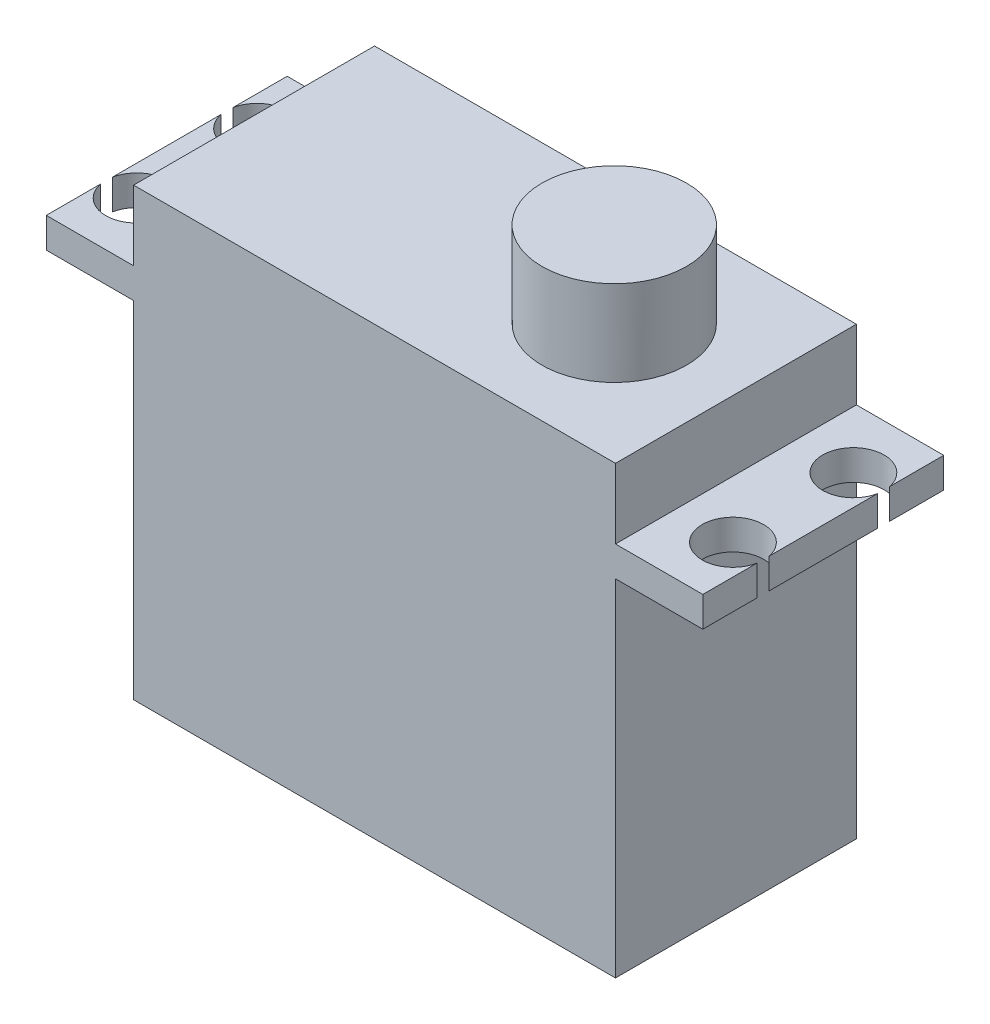
ISO-10303-21;
HEADER;
FILE_DESCRIPTION(('STEP AP214'),'2;1');
FILE_NAME('part.step','',(''),(''),'','','');
FILE_SCHEMA(('AUTOMOTIVE_DESIGN { 1 0 10303 214 1 1 1 1 }'));
ENDSEC;
DATA;
#1=APPLICATION_CONTEXT('core data for automotive mechanical design processes');
#2=APPLICATION_PROTOCOL_DEFINITION('international standard','automotive_design',2000,#1);
#3=PRODUCT_CONTEXT('',#1,'mechanical');
#4=PRODUCT('Part','Part','',(#3));
#5=PRODUCT_RELATED_PRODUCT_CATEGORY('part','',(#4));
#6=PRODUCT_DEFINITION_FORMATION('','',#4);
#7=PRODUCT_DEFINITION_CONTEXT('part definition',#1,'design');
#8=PRODUCT_DEFINITION('design','',#6,#7);
#9=PRODUCT_DEFINITION_SHAPE('','',#8);
#10=(LENGTH_UNIT() NAMED_UNIT(*) SI_UNIT(.MILLI.,.METRE.));
#11=(NAMED_UNIT(*) PLANE_ANGLE_UNIT() SI_UNIT($,.RADIAN.));
#12=(NAMED_UNIT(*) SI_UNIT($,.STERADIAN.) SOLID_ANGLE_UNIT());
#13=UNCERTAINTY_MEASURE_WITH_UNIT(LENGTH_MEASURE(1.E-05),#10,'distance_accuracy_value','');
#14=(GEOMETRIC_REPRESENTATION_CONTEXT(3) GLOBAL_UNCERTAINTY_ASSIGNED_CONTEXT((#13)) GLOBAL_UNIT_ASSIGNED_CONTEXT((#10,
#11,#12)) REPRESENTATION_CONTEXT('',''));
#15=CARTESIAN_POINT('',(0.,0.,0.));
#16=DIRECTION('',(0.,0.,1.));
#17=DIRECTION('',(1.,0.,0.));
#18=AXIS2_PLACEMENT_3D('',#15,#16,#17);
#19=CARTESIAN_POINT('',(27.25,31.2,10.));
#20=DIRECTION('',(-1.,0.,0.));
#21=DIRECTION('',(0.,0.,1.));
#22=AXIS2_PLACEMENT_3D('',#19,#20,#21);
#23=PLANE('',#22);
#24=DIRECTION('',(0.,0.,-1.));
#25=VECTOR('',#24,1.);
#26=CARTESIAN_POINT('',(27.25,28.7,10.));
#27=LINE('',#26,#25);
#28=CARTESIAN_POINT('',(27.25,28.7,4.497506218944));
#29=VERTEX_POINT('',#28);
#30=CARTESIAN_POINT('',(27.25,28.7,-4.49750621894393));
#31=VERTEX_POINT('',#30);
#32=EDGE_CURVE('E402',#29,#31,#27,.T.);
#33=ORIENTED_EDGE('',*,*,#32,.T.);
#34=DIRECTION('',(0.,1.,0.));
#35=VECTOR('',#34,1.);
#36=CARTESIAN_POINT('',(27.25,24.1,-4.49750621894393));
#37=LINE('',#36,#35);
#38=CARTESIAN_POINT('',(27.25,31.2,-4.49750621894393));
#39=VERTEX_POINT('',#38);
#40=EDGE_CURVE('E11',#31,#39,#37,.T.);
#41=ORIENTED_EDGE('',*,*,#40,.T.);
#42=DIRECTION('',(0.,0.,-1.));
#43=VECTOR('',#42,1.);
#44=CARTESIAN_POINT('',(27.25,31.2,10.));
#45=LINE('',#44,#43);
#46=CARTESIAN_POINT('',(27.25,31.2,4.497506218944));
#47=VERTEX_POINT('',#46);
#48=EDGE_CURVE('E234',#47,#39,#45,.T.);
#49=ORIENTED_EDGE('',*,*,#48,.F.);
#50=DIRECTION('',(0.,1.,0.));
#51=VECTOR('',#50,1.);
#52=CARTESIAN_POINT('',(27.25,24.1,4.497506218944));
#53=LINE('',#52,#51);
#54=EDGE_CURVE('E382',#47,#29,#53,.F.);
#55=ORIENTED_EDGE('',*,*,#54,.T.);
#56=EDGE_LOOP('',(#33,#41,#49,#55));
#57=FACE_BOUND('',#56,.T.);
#58=ADVANCED_FACE('F43',(#57),#23,.F.);
#59=CARTESIAN_POINT('',(27.25,28.7,10.));
#60=VERTEX_POINT('',#59);
#61=CARTESIAN_POINT('',(27.25,28.7,5.50249378105603));
#62=VERTEX_POINT('',#61);
#63=EDGE_CURVE('E403',#60,#62,#27,.T.);
#64=ORIENTED_EDGE('',*,*,#63,.T.);
#65=DIRECTION('',(0.,1.,0.));
#66=VECTOR('',#65,1.);
#67=CARTESIAN_POINT('',(27.25,24.1,5.50249378105603));
#68=LINE('',#67,#66);
#69=CARTESIAN_POINT('',(27.25,31.2,5.50249378105603));
#70=VERTEX_POINT('',#69);
#71=EDGE_CURVE('E385',#62,#70,#68,.T.);
#72=ORIENTED_EDGE('',*,*,#71,.T.);
#73=CARTESIAN_POINT('',(27.25,31.2,10.));
#74=VERTEX_POINT('',#73);
#75=EDGE_CURVE('E229',#74,#70,#45,.T.);
#76=ORIENTED_EDGE('',*,*,#75,.F.);
#77=DIRECTION('',(0.,-1.,0.));
#78=VECTOR('',#77,1.);
#79=CARTESIAN_POINT('',(27.25,31.2,10.));
#80=LINE('',#79,#78);
#81=EDGE_CURVE('E320',#74,#60,#80,.T.);
#82=ORIENTED_EDGE('',*,*,#81,.T.);
#83=EDGE_LOOP('',(#64,#72,#76,#82));
#84=FACE_BOUND('',#83,.T.);
#85=ADVANCED_FACE('F430',(#84),#23,.F.);
#86=CARTESIAN_POINT('',(-27.25,31.2,10.));
#87=DIRECTION('',(1.,0.,0.));
#88=DIRECTION('',(0.,0.,-1.));
#89=AXIS2_PLACEMENT_3D('',#86,#87,#88);
#90=PLANE('',#89);
#91=DIRECTION('',(0.,0.,1.));
#92=VECTOR('',#91,1.);
#93=CARTESIAN_POINT('',(-27.25,28.7,10.));
#94=LINE('',#93,#92);
#95=CARTESIAN_POINT('',(-27.25,28.7,-4.49750621894395));
#96=VERTEX_POINT('',#95);
#97=CARTESIAN_POINT('',(-27.25,28.7,4.49750621894395));
#98=VERTEX_POINT('',#97);
#99=EDGE_CURVE('E304',#96,#98,#94,.T.);
#100=ORIENTED_EDGE('',*,*,#99,.T.);
#101=DIRECTION('',(0.,1.,0.));
#102=VECTOR('',#101,1.);
#103=CARTESIAN_POINT('',(-27.25,24.1,4.49750621894395));
#104=LINE('',#103,#102);
#105=CARTESIAN_POINT('',(-27.25,31.2,4.49750621894395));
#106=VERTEX_POINT('',#105);
#107=EDGE_CURVE('E281',#98,#106,#104,.T.);
#108=ORIENTED_EDGE('',*,*,#107,.T.);
#109=DIRECTION('',(0.,0.,1.));
#110=VECTOR('',#109,1.);
#111=CARTESIAN_POINT('',(-27.25,31.2,10.));
#112=LINE('',#111,#110);
#113=CARTESIAN_POINT('',(-27.25,31.2,-4.49750621894395));
#114=VERTEX_POINT('',#113);
#115=EDGE_CURVE('E211',#114,#106,#112,.T.);
#116=ORIENTED_EDGE('',*,*,#115,.F.);
#117=DIRECTION('',(0.,1.,0.));
#118=VECTOR('',#117,1.);
#119=CARTESIAN_POINT('',(-27.25,24.1,-4.49750621894395));
#120=LINE('',#119,#118);
#121=EDGE_CURVE('E186',#114,#96,#120,.F.);
#122=ORIENTED_EDGE('',*,*,#121,.T.);
#123=EDGE_LOOP('',(#100,#108,#116,#122));
#124=FACE_BOUND('',#123,.T.);
#125=ADVANCED_FACE('F302',(#124),#90,.F.);
#126=CARTESIAN_POINT('',(-27.25,28.7,-10.));
#127=VERTEX_POINT('',#126);
#128=CARTESIAN_POINT('',(-27.25,28.7,-5.50249378105605));
#129=VERTEX_POINT('',#128);
#130=EDGE_CURVE('E201',#127,#129,#94,.T.);
#131=ORIENTED_EDGE('',*,*,#130,.T.);
#132=DIRECTION('',(0.,1.,0.));
#133=VECTOR('',#132,1.);
#134=CARTESIAN_POINT('',(-27.25,24.1,-5.50249378105605));
#135=LINE('',#134,#133);
#136=CARTESIAN_POINT('',(-27.25,31.2,-5.50249378105605));
#137=VERTEX_POINT('',#136);
#138=EDGE_CURVE('E183',#129,#137,#135,.T.);
#139=ORIENTED_EDGE('',*,*,#138,.T.);
#140=CARTESIAN_POINT('',(-27.25,31.2,-10.));
#141=VERTEX_POINT('',#140);
#142=EDGE_CURVE('E199',#141,#137,#112,.T.);
#143=ORIENTED_EDGE('',*,*,#142,.F.);
#144=DIRECTION('',(0.,-1.,0.));
#145=VECTOR('',#144,1.);
#146=CARTESIAN_POINT('',(-27.25,31.2,-10.));
#147=LINE('',#146,#145);
#148=EDGE_CURVE('E328',#141,#127,#147,.T.);
#149=ORIENTED_EDGE('',*,*,#148,.T.);
#150=EDGE_LOOP('',(#131,#139,#143,#149));
#151=FACE_BOUND('',#150,.T.);
#152=ADVANCED_FACE('F197',(#151),#90,.F.);
#153=CARTESIAN_POINT('',(0.,31.2,0.));
#154=DIRECTION('',(0.,-1.,0.));
#155=DIRECTION('',(0.,0.,-1.));
#156=AXIS2_PLACEMENT_3D('',#153,#154,#155);
#157=PLANE('',#156);
#158=ORIENTED_EDGE('',*,*,#48,.T.);
#159=CARTESIAN_POINT('',(24.75,31.2,-4.99999999999998));
#160=DIRECTION('',(0.,1.,0.));
#161=DIRECTION('',(0.,0.,-1.));
#162=AXIS2_PLACEMENT_3D('',#159,#160,#161);
#163=CIRCLE('',#162,2.55);
#164=CARTESIAN_POINT('',(27.25,31.2,-5.50249378105603));
#165=VERTEX_POINT('',#164);
#166=EDGE_CURVE('E290',#165,#39,#163,.T.);
#167=ORIENTED_EDGE('',*,*,#166,.F.);
#168=CARTESIAN_POINT('',(27.25,31.2,-10.));
#169=VERTEX_POINT('',#168);
#170=EDGE_CURVE('E235',#165,#169,#45,.T.);
#171=ORIENTED_EDGE('',*,*,#170,.T.);
#172=DIRECTION('',(-1.,0.,0.));
#173=VECTOR('',#172,1.);
#174=CARTESIAN_POINT('',(-27.25,31.2,-10.));
#175=LINE('',#174,#173);
#176=CARTESIAN_POINT('',(20.,31.2,-10.));
#177=VERTEX_POINT('',#176);
#178=EDGE_CURVE('E220',#169,#177,#175,.T.);
#179=ORIENTED_EDGE('',*,*,#178,.T.);
#180=DIRECTION('',(0.,0.,-1.));
#181=VECTOR('',#180,1.);
#182=CARTESIAN_POINT('',(20.,31.2,10.));
#183=LINE('',#182,#181);
#184=CARTESIAN_POINT('',(20.,31.2,10.));
#185=VERTEX_POINT('',#184);
#186=EDGE_CURVE('E258',#185,#177,#183,.T.);
#187=ORIENTED_EDGE('',*,*,#186,.F.);
#188=DIRECTION('',(1.,0.,0.));
#189=VECTOR('',#188,1.);
#190=CARTESIAN_POINT('',(-27.25,31.2,10.));
#191=LINE('',#190,#189);
#192=EDGE_CURVE('E210',#185,#74,#191,.T.);
#193=ORIENTED_EDGE('',*,*,#192,.T.);
#194=ORIENTED_EDGE('',*,*,#75,.T.);
#195=CARTESIAN_POINT('',(24.75,31.2,5.00000000000002));
#196=DIRECTION('',(0.,1.,0.));
#197=DIRECTION('',(0.,0.,1.));
#198=AXIS2_PLACEMENT_3D('',#195,#196,#197);
#199=CIRCLE('',#198,2.55);
#200=EDGE_CURVE('E293',#47,#70,#199,.T.);
#201=ORIENTED_EDGE('',*,*,#200,.F.);
#202=EDGE_LOOP('',(#158,#167,#171,#179,#187,#193,#194,#201));
#203=FACE_BOUND('',#202,.T.);
#204=ADVANCED_FACE('F423',(#203),#157,.F.);
#205=ORIENTED_EDGE('',*,*,#115,.T.);
#206=CARTESIAN_POINT('',(-24.75,31.2,5.));
#207=DIRECTION('',(0.,1.,0.));
#208=DIRECTION('',(0.,0.,-1.));
#209=AXIS2_PLACEMENT_3D('',#206,#207,#208);
#210=CIRCLE('',#209,2.55);
#211=CARTESIAN_POINT('',(-27.25,31.2,5.50249378105605));
#212=VERTEX_POINT('',#211);
#213=EDGE_CURVE('E192',#212,#106,#210,.T.);
#214=ORIENTED_EDGE('',*,*,#213,.F.);
#215=CARTESIAN_POINT('',(-27.25,31.2,10.));
#216=VERTEX_POINT('',#215);
#217=EDGE_CURVE('E213',#212,#216,#112,.T.);
#218=ORIENTED_EDGE('',*,*,#217,.T.);
#219=CARTESIAN_POINT('',(-20.,31.2,10.));
#220=VERTEX_POINT('',#219);
#221=EDGE_CURVE('E216',#216,#220,#191,.T.);
#222=ORIENTED_EDGE('',*,*,#221,.T.);
#223=DIRECTION('',(0.,0.,1.));
#224=VECTOR('',#223,1.);
#225=CARTESIAN_POINT('',(-20.,31.2,10.));
#226=LINE('',#225,#224);
#227=CARTESIAN_POINT('',(-20.,31.2,-10.));
#228=VERTEX_POINT('',#227);
#229=EDGE_CURVE('E253',#228,#220,#226,.T.);
#230=ORIENTED_EDGE('',*,*,#229,.F.);
#231=EDGE_CURVE('E207',#228,#141,#175,.T.);
#232=ORIENTED_EDGE('',*,*,#231,.T.);
#233=ORIENTED_EDGE('',*,*,#142,.T.);
#234=CARTESIAN_POINT('',(-24.75,31.2,-5.));
#235=DIRECTION('',(0.,1.,0.));
#236=DIRECTION('',(0.,0.,1.));
#237=AXIS2_PLACEMENT_3D('',#234,#235,#236);
#238=CIRCLE('',#237,2.55);
#239=EDGE_CURVE('E180',#114,#137,#238,.T.);
#240=ORIENTED_EDGE('',*,*,#239,.F.);
#241=EDGE_LOOP('',(#205,#214,#218,#222,#230,#232,#233,#240));
#242=FACE_BOUND('',#241,.T.);
#243=ADVANCED_FACE('F205',(#242),#157,.F.);
#244=CARTESIAN_POINT('',(20.,28.7,10.));
#245=DIRECTION('',(-1.,0.,0.));
#246=DIRECTION('',(0.,0.,1.));
#247=AXIS2_PLACEMENT_3D('',#244,#245,#246);
#248=PLANE('',#247);
#249=DIRECTION('',(0.,0.,-1.));
#250=VECTOR('',#249,1.);
#251=CARTESIAN_POINT('',(20.,0.,10.));
#252=LINE('',#251,#250);
#253=CARTESIAN_POINT('',(20.,0.,10.));
#254=VERTEX_POINT('',#253);
#255=CARTESIAN_POINT('',(20.,0.,-10.));
#256=VERTEX_POINT('',#255);
#257=EDGE_CURVE('E335',#254,#256,#252,.T.);
#258=ORIENTED_EDGE('',*,*,#257,.T.);
#259=DIRECTION('',(0.,-1.,0.));
#260=VECTOR('',#259,1.);
#261=CARTESIAN_POINT('',(20.,28.7,-10.));
#262=LINE('',#261,#260);
#263=CARTESIAN_POINT('',(20.,28.7,-10.));
#264=VERTEX_POINT('',#263);
#265=EDGE_CURVE('E368',#264,#256,#262,.T.);
#266=ORIENTED_EDGE('',*,*,#265,.F.);
#267=DIRECTION('',(0.,0.,-1.));
#268=VECTOR('',#267,1.);
#269=CARTESIAN_POINT('',(20.,28.7,10.));
#270=LINE('',#269,#268);
#271=CARTESIAN_POINT('',(20.,28.7,10.));
#272=VERTEX_POINT('',#271);
#273=EDGE_CURVE('E336',#272,#264,#270,.T.);
#274=ORIENTED_EDGE('',*,*,#273,.F.);
#275=DIRECTION('',(0.,-1.,0.));
#276=VECTOR('',#275,1.);
#277=CARTESIAN_POINT('',(20.,28.7,10.));
#278=LINE('',#277,#276);
#279=EDGE_CURVE('E345',#272,#254,#278,.T.);
#280=ORIENTED_EDGE('',*,*,#279,.T.);
#281=EDGE_LOOP('',(#258,#266,#274,#280));
#282=FACE_BOUND('',#281,.T.);
#283=ADVANCED_FACE('F45',(#282),#248,.F.);
#284=CARTESIAN_POINT('',(-20.,28.7,-10.));
#285=DIRECTION('',(0.,0.,1.));
#286=DIRECTION('',(1.,0.,0.));
#287=AXIS2_PLACEMENT_3D('',#284,#285,#286);
#288=PLANE('',#287);
#289=DIRECTION('',(-1.,0.,0.));
#290=VECTOR('',#289,1.);
#291=CARTESIAN_POINT('',(-20.,0.,-10.));
#292=LINE('',#291,#290);
#293=CARTESIAN_POINT('',(-20.,0.,-10.));
#294=VERTEX_POINT('',#293);
#295=EDGE_CURVE('E349',#256,#294,#292,.T.);
#296=ORIENTED_EDGE('',*,*,#295,.T.);
#297=DIRECTION('',(0.,-1.,0.));
#298=VECTOR('',#297,1.);
#299=CARTESIAN_POINT('',(-20.,28.7,-10.));
#300=LINE('',#299,#298);
#301=CARTESIAN_POINT('',(-20.,28.7,-10.));
#302=VERTEX_POINT('',#301);
#303=EDGE_CURVE('E364',#302,#294,#300,.T.);
#304=ORIENTED_EDGE('',*,*,#303,.F.);
#305=DIRECTION('',(-1.,0.,0.));
#306=VECTOR('',#305,1.);
#307=CARTESIAN_POINT('',(-27.25,28.7,-10.));
#308=LINE('',#307,#306);
#309=EDGE_CURVE('E407',#302,#127,#308,.T.);
#310=ORIENTED_EDGE('',*,*,#309,.T.);
#311=ORIENTED_EDGE('',*,*,#148,.F.);
#312=ORIENTED_EDGE('',*,*,#231,.F.);
#313=DIRECTION('',(0.,-1.,0.));
#314=VECTOR('',#313,1.);
#315=CARTESIAN_POINT('',(-20.,37.,-10.));
#316=LINE('',#315,#314);
#317=CARTESIAN_POINT('',(-20.,37.,-10.));
#318=VERTEX_POINT('',#317);
#319=EDGE_CURVE('E240',#318,#228,#316,.T.);
#320=ORIENTED_EDGE('',*,*,#319,.F.);
#321=DIRECTION('',(-1.,0.,0.));
#322=VECTOR('',#321,1.);
#323=CARTESIAN_POINT('',(-20.,37.,-10.));
#324=LINE('',#323,#322);
#325=CARTESIAN_POINT('',(20.,37.,-10.));
#326=VERTEX_POINT('',#325);
#327=EDGE_CURVE('E268',#326,#318,#324,.T.);
#328=ORIENTED_EDGE('',*,*,#327,.F.);
#329=DIRECTION('',(0.,-1.,0.));
#330=VECTOR('',#329,1.);
#331=CARTESIAN_POINT('',(20.,37.,-10.));
#332=LINE('',#331,#330);
#333=EDGE_CURVE('E236',#326,#177,#332,.T.);
#334=ORIENTED_EDGE('',*,*,#333,.T.);
#335=ORIENTED_EDGE('',*,*,#178,.F.);
#336=DIRECTION('',(0.,-1.,0.));
#337=VECTOR('',#336,1.);
#338=CARTESIAN_POINT('',(27.25,31.2,-10.));
#339=LINE('',#338,#337);
#340=CARTESIAN_POINT('',(27.25,28.7,-10.));
#341=VERTEX_POINT('',#340);
#342=EDGE_CURVE('E331',#169,#341,#339,.T.);
#343=ORIENTED_EDGE('',*,*,#342,.T.);
#344=EDGE_CURVE('E312',#341,#264,#308,.T.);
#345=ORIENTED_EDGE('',*,*,#344,.T.);
#346=ORIENTED_EDGE('',*,*,#265,.T.);
#347=EDGE_LOOP('',(#296,#304,#310,#311,#312,#320,#328,#334,#335,#343,#345,#346));
#348=FACE_BOUND('',#347,.T.);
#349=ADVANCED_FACE('F414',(#348),#288,.F.);
#350=CARTESIAN_POINT('',(-20.,28.7,10.));
#351=DIRECTION('',(1.,0.,0.));
#352=DIRECTION('',(0.,0.,-1.));
#353=AXIS2_PLACEMENT_3D('',#350,#351,#352);
#354=PLANE('',#353);
#355=DIRECTION('',(0.,0.,1.));
#356=VECTOR('',#355,1.);
#357=CARTESIAN_POINT('',(-20.,0.,10.));
#358=LINE('',#357,#356);
#359=CARTESIAN_POINT('',(-20.,0.,10.));
#360=VERTEX_POINT('',#359);
#361=EDGE_CURVE('E352',#294,#360,#358,.T.);
#362=ORIENTED_EDGE('',*,*,#361,.T.);
#363=DIRECTION('',(0.,-1.,0.));
#364=VECTOR('',#363,1.);
#365=CARTESIAN_POINT('',(-20.,28.7,10.));
#366=LINE('',#365,#364);
#367=CARTESIAN_POINT('',(-20.,28.7,10.));
#368=VERTEX_POINT('',#367);
#369=EDGE_CURVE('E360',#368,#360,#366,.T.);
#370=ORIENTED_EDGE('',*,*,#369,.F.);
#371=DIRECTION('',(0.,0.,1.));
#372=VECTOR('',#371,1.);
#373=CARTESIAN_POINT('',(-20.,28.7,10.));
#374=LINE('',#373,#372);
#375=EDGE_CURVE('E340',#302,#368,#374,.T.);
#376=ORIENTED_EDGE('',*,*,#375,.F.);
#377=ORIENTED_EDGE('',*,*,#303,.T.);
#378=EDGE_LOOP('',(#362,#370,#376,#377));
#379=FACE_BOUND('',#378,.T.);
#380=ADVANCED_FACE('F493',(#379),#354,.F.);
#381=CARTESIAN_POINT('',(-20.,28.7,10.));
#382=DIRECTION('',(0.,0.,-1.));
#383=DIRECTION('',(-1.,0.,0.));
#384=AXIS2_PLACEMENT_3D('',#381,#382,#383);
#385=PLANE('',#384);
#386=DIRECTION('',(1.,0.,0.));
#387=VECTOR('',#386,1.);
#388=CARTESIAN_POINT('',(-20.,0.,10.));
#389=LINE('',#388,#387);
#390=EDGE_CURVE('E341',#360,#254,#389,.T.);
#391=ORIENTED_EDGE('',*,*,#390,.T.);
#392=ORIENTED_EDGE('',*,*,#279,.F.);
#393=DIRECTION('',(1.,0.,0.));
#394=VECTOR('',#393,1.);
#395=CARTESIAN_POINT('',(-27.25,28.7,10.));
#396=LINE('',#395,#394);
#397=EDGE_CURVE('E311',#272,#60,#396,.T.);
#398=ORIENTED_EDGE('',*,*,#397,.T.);
#399=ORIENTED_EDGE('',*,*,#81,.F.);
#400=ORIENTED_EDGE('',*,*,#192,.F.);
#401=DIRECTION('',(0.,-1.,0.));
#402=VECTOR('',#401,1.);
#403=CARTESIAN_POINT('',(20.,37.,10.));
#404=LINE('',#403,#402);
#405=CARTESIAN_POINT('',(20.,37.,10.));
#406=VERTEX_POINT('',#405);
#407=EDGE_CURVE('E248',#406,#185,#404,.T.);
#408=ORIENTED_EDGE('',*,*,#407,.F.);
#409=DIRECTION('',(1.,0.,0.));
#410=VECTOR('',#409,1.);
#411=CARTESIAN_POINT('',(-20.,37.,10.));
#412=LINE('',#411,#410);
#413=CARTESIAN_POINT('',(-20.,37.,10.));
#414=VERTEX_POINT('',#413);
#415=EDGE_CURVE('E252',#414,#406,#412,.T.);
#416=ORIENTED_EDGE('',*,*,#415,.F.);
#417=DIRECTION('',(0.,-1.,0.));
#418=VECTOR('',#417,1.);
#419=CARTESIAN_POINT('',(-20.,37.,10.));
#420=LINE('',#419,#418);
#421=EDGE_CURVE('E244',#414,#220,#420,.T.);
#422=ORIENTED_EDGE('',*,*,#421,.T.);
#423=ORIENTED_EDGE('',*,*,#221,.F.);
#424=DIRECTION('',(0.,-1.,0.));
#425=VECTOR('',#424,1.);
#426=CARTESIAN_POINT('',(-27.25,31.2,10.));
#427=LINE('',#426,#425);
#428=CARTESIAN_POINT('',(-27.25,28.7,10.));
#429=VERTEX_POINT('',#428);
#430=EDGE_CURVE('E324',#216,#429,#427,.T.);
#431=ORIENTED_EDGE('',*,*,#430,.T.);
#432=EDGE_CURVE('E316',#429,#368,#396,.T.);
#433=ORIENTED_EDGE('',*,*,#432,.T.);
#434=ORIENTED_EDGE('',*,*,#369,.T.);
#435=EDGE_LOOP('',(#391,#392,#398,#399,#400,#408,#416,#422,#423,#431,#433,#434));
#436=FACE_BOUND('',#435,.T.);
#437=ADVANCED_FACE('F426',(#436),#385,.F.);
#438=CARTESIAN_POINT('',(0.,0.,0.));
#439=DIRECTION('',(0.,-1.,0.));
#440=DIRECTION('',(0.,0.,-1.));
#441=AXIS2_PLACEMENT_3D('',#438,#439,#440);
#442=PLANE('',#441);
#443=ORIENTED_EDGE('',*,*,#257,.F.);
#444=ORIENTED_EDGE('',*,*,#390,.F.);
#445=ORIENTED_EDGE('',*,*,#361,.F.);
#446=ORIENTED_EDGE('',*,*,#295,.F.);
#447=EDGE_LOOP('',(#443,#444,#445,#446));
#448=FACE_BOUND('',#447,.T.);
#449=ADVANCED_FACE('F460',(#448),#442,.T.);
#450=CARTESIAN_POINT('',(0.,28.7,0.));
#451=DIRECTION('',(0.,-1.,0.));
#452=DIRECTION('',(0.,0.,-1.));
#453=AXIS2_PLACEMENT_3D('',#450,#451,#452);
#454=PLANE('',#453);
#455=CARTESIAN_POINT('',(24.75,28.7,-4.99999999999998));
#456=DIRECTION('',(0.,-1.,0.));
#457=DIRECTION('',(0.,0.,-1.));
#458=AXIS2_PLACEMENT_3D('',#455,#456,#457);
#459=CIRCLE('',#458,2.55);
#460=CARTESIAN_POINT('',(27.25,28.7,-5.50249378105603));
#461=VERTEX_POINT('',#460);
#462=EDGE_CURVE('E59',#31,#461,#459,.T.);
#463=ORIENTED_EDGE('',*,*,#462,.F.);
#464=ORIENTED_EDGE('',*,*,#32,.F.);
#465=CARTESIAN_POINT('',(24.75,28.7,5.00000000000002));
#466=DIRECTION('',(0.,-1.,0.));
#467=DIRECTION('',(0.,0.,-1.));
#468=AXIS2_PLACEMENT_3D('',#465,#466,#467);
#469=CIRCLE('',#468,2.55);
#470=EDGE_CURVE('E67',#62,#29,#469,.T.);
#471=ORIENTED_EDGE('',*,*,#470,.F.);
#472=ORIENTED_EDGE('',*,*,#63,.F.);
#473=ORIENTED_EDGE('',*,*,#397,.F.);
#474=ORIENTED_EDGE('',*,*,#273,.T.);
#475=ORIENTED_EDGE('',*,*,#344,.F.);
#476=EDGE_CURVE('E239',#461,#341,#27,.T.);
#477=ORIENTED_EDGE('',*,*,#476,.F.);
#478=EDGE_LOOP('',(#463,#464,#471,#472,#473,#474,#475,#477));
#479=FACE_BOUND('',#478,.T.);
#480=ADVANCED_FACE('F397',(#479),#454,.T.);
#481=ORIENTED_EDGE('',*,*,#170,.F.);
#482=DIRECTION('',(0.,1.,0.));
#483=VECTOR('',#482,1.);
#484=CARTESIAN_POINT('',(27.25,24.1,-5.50249378105603));
#485=LINE('',#484,#483);
#486=EDGE_CURVE('E52',#165,#461,#485,.F.);
#487=ORIENTED_EDGE('',*,*,#486,.T.);
#488=ORIENTED_EDGE('',*,*,#476,.T.);
#489=ORIENTED_EDGE('',*,*,#342,.F.);
#490=EDGE_LOOP('',(#481,#487,#488,#489));
#491=FACE_BOUND('',#490,.T.);
#492=ADVANCED_FACE('F392',(#491),#23,.F.);
#493=ORIENTED_EDGE('',*,*,#217,.F.);
#494=DIRECTION('',(0.,1.,0.));
#495=VECTOR('',#494,1.);
#496=CARTESIAN_POINT('',(-27.25,24.1,5.50249378105605));
#497=LINE('',#496,#495);
#498=CARTESIAN_POINT('',(-27.25,28.7,5.50249378105605));
#499=VERTEX_POINT('',#498);
#500=EDGE_CURVE('E203',#212,#499,#497,.F.);
#501=ORIENTED_EDGE('',*,*,#500,.T.);
#502=EDGE_CURVE('E307',#499,#429,#94,.T.);
#503=ORIENTED_EDGE('',*,*,#502,.T.);
#504=ORIENTED_EDGE('',*,*,#430,.F.);
#505=EDGE_LOOP('',(#493,#501,#503,#504));
#506=FACE_BOUND('',#505,.T.);
#507=ADVANCED_FACE('F453',(#506),#90,.F.);
#508=CARTESIAN_POINT('',(-24.75,28.7,5.));
#509=DIRECTION('',(0.,-1.,0.));
#510=DIRECTION('',(0.,0.,-1.));
#511=AXIS2_PLACEMENT_3D('',#508,#509,#510);
#512=CIRCLE('',#511,2.55);
#513=EDGE_CURVE('E379',#98,#499,#512,.T.);
#514=ORIENTED_EDGE('',*,*,#513,.F.);
#515=ORIENTED_EDGE('',*,*,#99,.F.);
#516=CARTESIAN_POINT('',(-24.75,28.7,-5.));
#517=DIRECTION('',(0.,-1.,0.));
#518=DIRECTION('',(0.,0.,-1.));
#519=AXIS2_PLACEMENT_3D('',#516,#517,#518);
#520=CIRCLE('',#519,2.55);
#521=EDGE_CURVE('E376',#129,#96,#520,.T.);
#522=ORIENTED_EDGE('',*,*,#521,.F.);
#523=ORIENTED_EDGE('',*,*,#130,.F.);
#524=ORIENTED_EDGE('',*,*,#309,.F.);
#525=ORIENTED_EDGE('',*,*,#375,.T.);
#526=ORIENTED_EDGE('',*,*,#432,.F.);
#527=ORIENTED_EDGE('',*,*,#502,.F.);
#528=EDGE_LOOP('',(#514,#515,#522,#523,#524,#525,#526,#527));
#529=FACE_BOUND('',#528,.T.);
#530=ADVANCED_FACE('F458',(#529),#454,.T.);
#531=CARTESIAN_POINT('',(20.,37.,10.));
#532=DIRECTION('',(-1.,0.,0.));
#533=DIRECTION('',(0.,0.,1.));
#534=AXIS2_PLACEMENT_3D('',#531,#532,#533);
#535=PLANE('',#534);
#536=ORIENTED_EDGE('',*,*,#186,.T.);
#537=ORIENTED_EDGE('',*,*,#333,.F.);
#538=DIRECTION('',(0.,0.,-1.));
#539=VECTOR('',#538,1.);
#540=CARTESIAN_POINT('',(20.,37.,10.));
#541=LINE('',#540,#539);
#542=EDGE_CURVE('E257',#406,#326,#541,.T.);
#543=ORIENTED_EDGE('',*,*,#542,.F.);
#544=ORIENTED_EDGE('',*,*,#407,.T.);
#545=EDGE_LOOP('',(#536,#537,#543,#544));
#546=FACE_BOUND('',#545,.T.);
#547=ADVANCED_FACE('F419',(#546),#535,.F.);
#548=CARTESIAN_POINT('',(-20.,37.,10.));
#549=DIRECTION('',(1.,0.,0.));
#550=DIRECTION('',(0.,0.,-1.));
#551=AXIS2_PLACEMENT_3D('',#548,#549,#550);
#552=PLANE('',#551);
#553=ORIENTED_EDGE('',*,*,#229,.T.);
#554=ORIENTED_EDGE('',*,*,#421,.F.);
#555=DIRECTION('',(0.,0.,1.));
#556=VECTOR('',#555,1.);
#557=CARTESIAN_POINT('',(-20.,37.,10.));
#558=LINE('',#557,#556);
#559=EDGE_CURVE('E265',#318,#414,#558,.T.);
#560=ORIENTED_EDGE('',*,*,#559,.F.);
#561=ORIENTED_EDGE('',*,*,#319,.T.);
#562=EDGE_LOOP('',(#553,#554,#560,#561));
#563=FACE_BOUND('',#562,.T.);
#564=ADVANCED_FACE('F471',(#563),#552,.F.);
#565=CARTESIAN_POINT('',(0.,37.,0.));
#566=DIRECTION('',(0.,-1.,0.));
#567=DIRECTION('',(0.,0.,-1.));
#568=AXIS2_PLACEMENT_3D('',#565,#566,#567);
#569=PLANE('',#568);
#570=CARTESIAN_POINT('',(9.9,37.,0.));
#571=DIRECTION('',(0.,-1.,0.));
#572=DIRECTION('',(0.,0.,-1.));
#573=AXIS2_PLACEMENT_3D('',#570,#571,#572);
#574=CIRCLE('',#573,6.);
#575=CARTESIAN_POINT('',(9.9,37.,-6.));
#576=VERTEX_POINT('',#575);
#577=EDGE_CURVE('E372',#576,#576,#574,.F.);
#578=ORIENTED_EDGE('',*,*,#577,.F.);
#579=EDGE_LOOP('',(#578));
#580=FACE_BOUND('',#579,.T.);
#581=ORIENTED_EDGE('',*,*,#542,.T.);
#582=ORIENTED_EDGE('',*,*,#327,.T.);
#583=ORIENTED_EDGE('',*,*,#559,.T.);
#584=ORIENTED_EDGE('',*,*,#415,.T.);
#585=EDGE_LOOP('',(#581,#582,#583,#584));
#586=FACE_BOUND('',#585,.T.);
#587=ADVANCED_FACE('F500',(#580,#586),#569,.F.);
#588=CARTESIAN_POINT('',(9.9,44.1,0.));
#589=DIRECTION('',(0.,-1.,0.));
#590=DIRECTION('',(0.,0.,-1.));
#591=AXIS2_PLACEMENT_3D('',#588,#589,#590);
#592=CYLINDRICAL_SURFACE('',#591,6.);
#593=CARTESIAN_POINT('',(9.9,44.1,0.));
#594=DIRECTION('',(0.,1.,0.));
#595=DIRECTION('',(0.,0.,1.));
#596=AXIS2_PLACEMENT_3D('',#593,#594,#595);
#597=CIRCLE('',#596,6.);
#598=CARTESIAN_POINT('',(9.9,44.1,6.));
#599=VERTEX_POINT('',#598);
#600=EDGE_CURVE('E262',#599,#599,#597,.T.);
#601=ORIENTED_EDGE('',*,*,#600,.F.);
#602=EDGE_LOOP('',(#601));
#603=FACE_BOUND('',#602,.T.);
#604=ORIENTED_EDGE('',*,*,#577,.T.);
#605=EDGE_LOOP('',(#604));
#606=FACE_BOUND('',#605,.T.);
#607=ADVANCED_FACE('F503',(#603,#606),#592,.T.);
#608=CARTESIAN_POINT('',(9.9,44.1,0.));
#609=DIRECTION('',(0.,1.,0.));
#610=DIRECTION('',(0.,0.,1.));
#611=AXIS2_PLACEMENT_3D('',#608,#609,#610);
#612=PLANE('',#611);
#613=ORIENTED_EDGE('',*,*,#600,.T.);
#614=EDGE_LOOP('',(#613));
#615=FACE_BOUND('',#614,.T.);
#616=ADVANCED_FACE('F507',(#615),#612,.T.);
#617=CARTESIAN_POINT('',(-24.75,24.1,-5.));
#618=DIRECTION('',(0.,1.,0.));
#619=DIRECTION('',(0.,0.,1.));
#620=AXIS2_PLACEMENT_3D('',#617,#618,#619);
#621=CYLINDRICAL_SURFACE('',#620,2.55);
#622=ORIENTED_EDGE('',*,*,#521,.T.);
#623=ORIENTED_EDGE('',*,*,#121,.F.);
#624=ORIENTED_EDGE('',*,*,#239,.T.);
#625=ORIENTED_EDGE('',*,*,#138,.F.);
#626=EDGE_LOOP('',(#622,#623,#624,#625));
#627=FACE_BOUND('',#626,.T.);
#628=ADVANCED_FACE('F182',(#627),#621,.F.);
#629=CARTESIAN_POINT('',(-24.75,24.1,5.));
#630=DIRECTION('',(0.,1.,0.));
#631=DIRECTION('',(0.,0.,1.));
#632=AXIS2_PLACEMENT_3D('',#629,#630,#631);
#633=CYLINDRICAL_SURFACE('',#632,2.55);
#634=ORIENTED_EDGE('',*,*,#513,.T.);
#635=ORIENTED_EDGE('',*,*,#500,.F.);
#636=ORIENTED_EDGE('',*,*,#213,.T.);
#637=ORIENTED_EDGE('',*,*,#107,.F.);
#638=EDGE_LOOP('',(#634,#635,#636,#637));
#639=FACE_BOUND('',#638,.T.);
#640=ADVANCED_FACE('F298',(#639),#633,.F.);
#641=CARTESIAN_POINT('',(24.75,24.1,5.00000000000002));
#642=DIRECTION('',(0.,1.,0.));
#643=DIRECTION('',(0.,0.,1.));
#644=AXIS2_PLACEMENT_3D('',#641,#642,#643);
#645=CYLINDRICAL_SURFACE('',#644,2.55);
#646=ORIENTED_EDGE('',*,*,#470,.T.);
#647=ORIENTED_EDGE('',*,*,#54,.F.);
#648=ORIENTED_EDGE('',*,*,#200,.T.);
#649=ORIENTED_EDGE('',*,*,#71,.F.);
#650=EDGE_LOOP('',(#646,#647,#648,#649));
#651=FACE_BOUND('',#650,.T.);
#652=ADVANCED_FACE('F438',(#651),#645,.F.);
#653=CARTESIAN_POINT('',(24.75,24.1,-4.99999999999998));
#654=DIRECTION('',(0.,1.,0.));
#655=DIRECTION('',(0.,0.,1.));
#656=AXIS2_PLACEMENT_3D('',#653,#654,#655);
#657=CYLINDRICAL_SURFACE('',#656,2.55);
#658=ORIENTED_EDGE('',*,*,#462,.T.);
#659=ORIENTED_EDGE('',*,*,#486,.F.);
#660=ORIENTED_EDGE('',*,*,#166,.T.);
#661=ORIENTED_EDGE('',*,*,#40,.F.);
#662=EDGE_LOOP('',(#658,#659,#660,#661));
#663=FACE_BOUND('',#662,.T.);
#664=ADVANCED_FACE('F436',(#663),#657,.F.);
#665=CLOSED_SHELL('',(#58,#85,#125,#152,#204,#243,#283,#349,#380,#437,#449,#480,#492,#507,#530,
#547,#564,#587,#607,#616,#628,#640,#652,#664));
#666=MANIFOLD_SOLID_BREP('B2',#665);
#667=ADVANCED_BREP_SHAPE_REPRESENTATION('',(#18,#666),#14);
#668=SHAPE_DEFINITION_REPRESENTATION(#9,#667);
ENDSEC;
END-ISO-10303-21;
